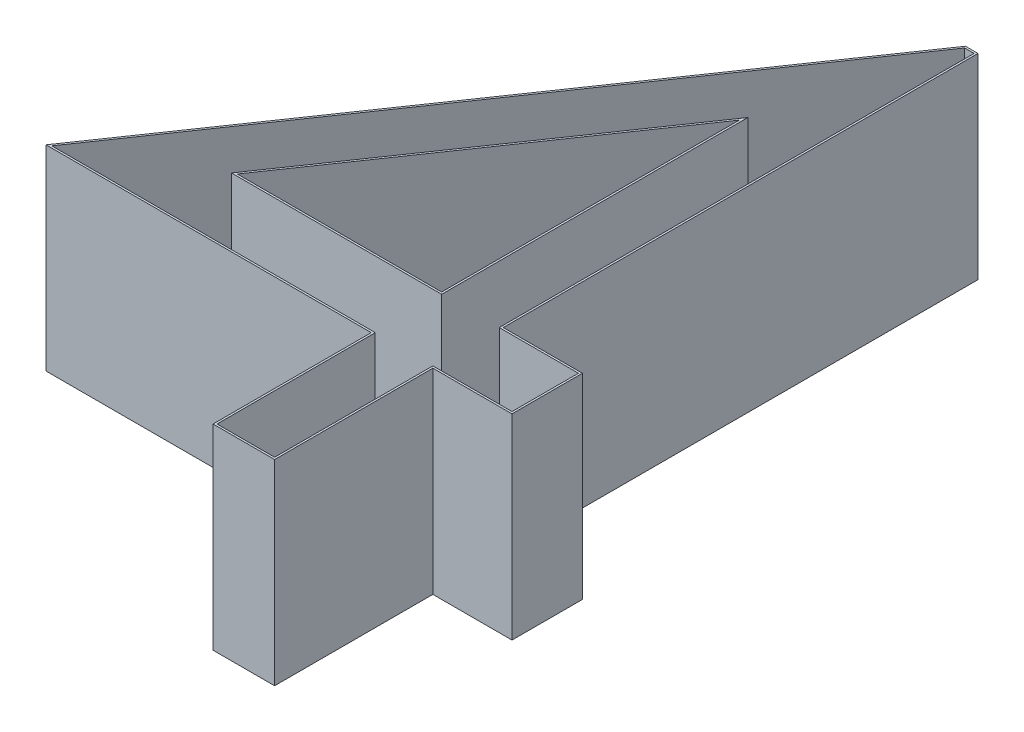
ISO-10303-21;
HEADER;
FILE_DESCRIPTION(('STEP AP214'),'2;1');
FILE_NAME('part.step','',(''),(''),'','','');
FILE_SCHEMA(('AUTOMOTIVE_DESIGN { 1 0 10303 214 1 1 1 1 }'));
ENDSEC;
DATA;
#1=APPLICATION_CONTEXT('core data for automotive mechanical design processes');
#2=APPLICATION_PROTOCOL_DEFINITION('international standard','automotive_design',2000,#1);
#3=PRODUCT_CONTEXT('',#1,'mechanical');
#4=PRODUCT('Part','Part','',(#3));
#5=PRODUCT_RELATED_PRODUCT_CATEGORY('part','',(#4));
#6=PRODUCT_DEFINITION_FORMATION('','',#4);
#7=PRODUCT_DEFINITION_CONTEXT('part definition',#1,'design');
#8=PRODUCT_DEFINITION('design','',#6,#7);
#9=PRODUCT_DEFINITION_SHAPE('','',#8);
#10=(LENGTH_UNIT() NAMED_UNIT(*) SI_UNIT(.MILLI.,.METRE.));
#11=(NAMED_UNIT(*) PLANE_ANGLE_UNIT() SI_UNIT($,.RADIAN.));
#12=(NAMED_UNIT(*) SI_UNIT($,.STERADIAN.) SOLID_ANGLE_UNIT());
#13=UNCERTAINTY_MEASURE_WITH_UNIT(LENGTH_MEASURE(1.E-05),#10,'distance_accuracy_value','');
#14=(GEOMETRIC_REPRESENTATION_CONTEXT(3) GLOBAL_UNCERTAINTY_ASSIGNED_CONTEXT((#13)) GLOBAL_UNIT_ASSIGNED_CONTEXT((#10,
#11,#12)) REPRESENTATION_CONTEXT('',''));
#15=CARTESIAN_POINT('',(0.,0.,0.));
#16=DIRECTION('',(0.,0.,1.));
#17=DIRECTION('',(1.,0.,0.));
#18=AXIS2_PLACEMENT_3D('',#15,#16,#17);
#19=CARTESIAN_POINT('',(0.,1.,0.));
#20=DIRECTION('',(0.,-1.,0.));
#21=DIRECTION('',(0.,0.,-1.));
#22=AXIS2_PLACEMENT_3D('',#19,#20,#21);
#23=PLANE('',#22);
#24=DIRECTION('',(-0.566105543193208,0.,0.824332768950697));
#25=VECTOR('',#24,1.);
#26=CARTESIAN_POINT('',(2.05043585939203,1.,-3.57974358974359));
#27=LINE('',#26,#25);
#28=CARTESIAN_POINT('',(2.05043585939203,1.,-3.57974358974359));
#29=VERTEX_POINT('',#28);
#30=CARTESIAN_POINT('',(0.153613847398646,1.,-0.817692307692308));
#31=VERTEX_POINT('',#30);
#32=EDGE_CURVE('E55',#29,#31,#27,.T.);
#33=ORIENTED_EDGE('',*,*,#32,.F.);
#34=DIRECTION('',(-1.,0.,0.));
#35=VECTOR('',#34,1.);
#36=CARTESIAN_POINT('',(2.09897435897436,1.,-3.57974358974359));
#37=LINE('',#36,#35);
#38=CARTESIAN_POINT('',(2.09897435897436,1.,-3.57974358974359));
#39=VERTEX_POINT('',#38);
#40=EDGE_CURVE('E131',#39,#29,#37,.T.);
#41=ORIENTED_EDGE('',*,*,#40,.F.);
#42=DIRECTION('',(0.,0.,-1.));
#43=VECTOR('',#42,1.);
#44=CARTESIAN_POINT('',(2.09897435897436,1.,-1.15666666666667));
#45=LINE('',#44,#43);
#46=CARTESIAN_POINT('',(2.09897435897436,1.,-1.15666666666667));
#47=VERTEX_POINT('',#46);
#48=EDGE_CURVE('E196',#47,#39,#45,.T.);
#49=ORIENTED_EDGE('',*,*,#48,.F.);
#50=DIRECTION('',(-1.,0.,0.));
#51=VECTOR('',#50,1.);
#52=CARTESIAN_POINT('',(2.50282051282051,1.,-1.15666666666667));
#53=LINE('',#52,#51);
#54=CARTESIAN_POINT('',(2.50282051282051,1.,-1.15666666666667));
#55=VERTEX_POINT('',#54);
#56=EDGE_CURVE('E192',#55,#47,#53,.T.);
#57=ORIENTED_EDGE('',*,*,#56,.F.);
#58=DIRECTION('',(0.,0.,-1.));
#59=VECTOR('',#58,1.);
#60=CARTESIAN_POINT('',(2.50282051282051,1.,-0.817692307692308));
#61=LINE('',#60,#59);
#62=CARTESIAN_POINT('',(2.50282051282051,1.,-0.817692307692308));
#63=VERTEX_POINT('',#62);
#64=EDGE_CURVE('E188',#63,#55,#61,.T.);
#65=ORIENTED_EDGE('',*,*,#64,.F.);
#66=DIRECTION('',(1.,0.,0.));
#67=VECTOR('',#66,1.);
#68=CARTESIAN_POINT('',(2.09897435897436,1.,-0.817692307692308));
#69=LINE('',#68,#67);
#70=CARTESIAN_POINT('',(2.09897435897436,1.,-0.817692307692308));
#71=VERTEX_POINT('',#70);
#72=EDGE_CURVE('E184',#71,#63,#69,.T.);
#73=ORIENTED_EDGE('',*,*,#72,.F.);
#74=DIRECTION('',(0.,0.,-1.));
#75=VECTOR('',#74,1.);
#76=CARTESIAN_POINT('',(2.09897435897436,1.,-0.01));
#77=LINE('',#76,#75);
#78=CARTESIAN_POINT('',(2.09897435897436,1.,-0.01));
#79=VERTEX_POINT('',#78);
#80=EDGE_CURVE('E180',#79,#71,#77,.T.);
#81=ORIENTED_EDGE('',*,*,#80,.F.);
#82=DIRECTION('',(1.,0.,0.));
#83=VECTOR('',#82,1.);
#84=CARTESIAN_POINT('',(1.8048717948718,1.,-0.01));
#85=LINE('',#84,#83);
#86=CARTESIAN_POINT('',(1.8048717948718,1.,-0.01));
#87=VERTEX_POINT('',#86);
#88=EDGE_CURVE('E122',#87,#79,#85,.T.);
#89=ORIENTED_EDGE('',*,*,#88,.F.);
#90=DIRECTION('',(0.,0.,1.));
#91=VECTOR('',#90,1.);
#92=CARTESIAN_POINT('',(1.8048717948718,1.,-0.817692307692308));
#93=LINE('',#92,#91);
#94=CARTESIAN_POINT('',(1.8048717948718,1.,-0.817692307692308));
#95=VERTEX_POINT('',#94);
#96=EDGE_CURVE('E107',#95,#87,#93,.T.);
#97=ORIENTED_EDGE('',*,*,#96,.F.);
#98=DIRECTION('',(1.,0.,0.));
#99=VECTOR('',#98,1.);
#100=CARTESIAN_POINT('',(0.153613847398646,1.,-0.817692307692308));
#101=LINE('',#100,#99);
#102=EDGE_CURVE('E112',#31,#95,#101,.T.);
#103=ORIENTED_EDGE('',*,*,#102,.F.);
#104=EDGE_LOOP('',(#33,#41,#49,#57,#65,#73,#81,#89,#97,#103));
#105=FACE_BOUND('',#104,.T.);
#106=DIRECTION('',(0.566105543193208,0.,-0.824332768950697));
#107=VECTOR('',#106,1.);
#108=CARTESIAN_POINT('',(0.134615384615385,1.,-0.807692307692308));
#109=LINE('',#108,#107);
#110=CARTESIAN_POINT('',(0.134615384615385,1.,-0.807692307692308));
#111=VERTEX_POINT('',#110);
#112=CARTESIAN_POINT('',(2.04517227564103,1.,-3.58974358974359));
#113=VERTEX_POINT('',#112);
#114=EDGE_CURVE('E307',#111,#113,#109,.T.);
#115=ORIENTED_EDGE('',*,*,#114,.F.);
#116=DIRECTION('',(-1.,0.,0.));
#117=VECTOR('',#116,1.);
#118=CARTESIAN_POINT('',(1.7948717948718,1.,-0.807692307692308));
#119=LINE('',#118,#117);
#120=CARTESIAN_POINT('',(1.7948717948718,1.,-0.807692307692308));
#121=VERTEX_POINT('',#120);
#122=EDGE_CURVE('E306',#121,#111,#119,.T.);
#123=ORIENTED_EDGE('',*,*,#122,.F.);
#124=DIRECTION('',(0.,0.,-1.));
#125=VECTOR('',#124,1.);
#126=CARTESIAN_POINT('',(1.7948717948718,1.,0.));
#127=LINE('',#126,#125);
#128=CARTESIAN_POINT('',(1.7948717948718,1.,0.));
#129=VERTEX_POINT('',#128);
#130=EDGE_CURVE('E347',#129,#121,#127,.T.);
#131=ORIENTED_EDGE('',*,*,#130,.F.);
#132=DIRECTION('',(-1.,0.,0.));
#133=VECTOR('',#132,1.);
#134=CARTESIAN_POINT('',(2.10897435897436,1.,0.));
#135=LINE('',#134,#133);
#136=CARTESIAN_POINT('',(2.10897435897436,1.,0.));
#137=VERTEX_POINT('',#136);
#138=EDGE_CURVE('E343',#137,#129,#135,.T.);
#139=ORIENTED_EDGE('',*,*,#138,.F.);
#140=DIRECTION('',(0.,0.,1.));
#141=VECTOR('',#140,1.);
#142=CARTESIAN_POINT('',(2.10897435897436,1.,-0.807692307692308));
#143=LINE('',#142,#141);
#144=CARTESIAN_POINT('',(2.10897435897436,1.,-0.807692307692308));
#145=VERTEX_POINT('',#144);
#146=EDGE_CURVE('E339',#145,#137,#143,.T.);
#147=ORIENTED_EDGE('',*,*,#146,.F.);
#148=DIRECTION('',(-1.,0.,0.));
#149=VECTOR('',#148,1.);
#150=CARTESIAN_POINT('',(2.51282051282051,1.,-0.807692307692308));
#151=LINE('',#150,#149);
#152=CARTESIAN_POINT('',(2.51282051282051,1.,-0.807692307692308));
#153=VERTEX_POINT('',#152);
#154=EDGE_CURVE('E335',#153,#145,#151,.T.);
#155=ORIENTED_EDGE('',*,*,#154,.F.);
#156=DIRECTION('',(0.,0.,1.));
#157=VECTOR('',#156,1.);
#158=CARTESIAN_POINT('',(2.51282051282051,1.,-1.16666666666667));
#159=LINE('',#158,#157);
#160=CARTESIAN_POINT('',(2.51282051282051,1.,-1.16666666666667));
#161=VERTEX_POINT('',#160);
#162=EDGE_CURVE('E331',#161,#153,#159,.T.);
#163=ORIENTED_EDGE('',*,*,#162,.F.);
#164=DIRECTION('',(1.,0.,0.));
#165=VECTOR('',#164,1.);
#166=CARTESIAN_POINT('',(2.10897435897436,1.,-1.16666666666667));
#167=LINE('',#166,#165);
#168=CARTESIAN_POINT('',(2.10897435897436,1.,-1.16666666666667));
#169=VERTEX_POINT('',#168);
#170=EDGE_CURVE('E327',#169,#161,#167,.T.);
#171=ORIENTED_EDGE('',*,*,#170,.F.);
#172=DIRECTION('',(0.,0.,1.));
#173=VECTOR('',#172,1.);
#174=CARTESIAN_POINT('',(2.10897435897436,1.,-3.58974358974359));
#175=LINE('',#174,#173);
#176=CARTESIAN_POINT('',(2.10897435897436,1.,-3.58974358974359));
#177=VERTEX_POINT('',#176);
#178=EDGE_CURVE('E315',#177,#169,#175,.T.);
#179=ORIENTED_EDGE('',*,*,#178,.F.);
#180=DIRECTION('',(1.,0.,0.));
#181=VECTOR('',#180,1.);
#182=CARTESIAN_POINT('',(2.04517227564103,1.,-3.58974358974359));
#183=LINE('',#182,#181);
#184=EDGE_CURVE('E299',#113,#177,#183,.T.);
#185=ORIENTED_EDGE('',*,*,#184,.F.);
#186=EDGE_LOOP('',(#115,#123,#131,#139,#147,#155,#163,#171,#179,#185));
#187=FACE_BOUND('',#186,.T.);
#188=ADVANCED_FACE('F45',(#105,#187),#23,.F.);
#189=CARTESIAN_POINT('',(0.,0.,0.));
#190=DIRECTION('',(0.,-1.,0.));
#191=DIRECTION('',(0.,0.,-1.));
#192=AXIS2_PLACEMENT_3D('',#189,#190,#191);
#193=PLANE('',#192);
#194=DIRECTION('',(-1.,0.,0.));
#195=VECTOR('',#194,1.);
#196=CARTESIAN_POINT('',(2.09897435897436,0.,-3.57974358974359));
#197=LINE('',#196,#195);
#198=CARTESIAN_POINT('',(2.09897435897436,0.,-3.57974358974359));
#199=VERTEX_POINT('',#198);
#200=CARTESIAN_POINT('',(2.05043585939203,0.,-3.57974358974359));
#201=VERTEX_POINT('',#200);
#202=EDGE_CURVE('E49',#199,#201,#197,.T.);
#203=ORIENTED_EDGE('',*,*,#202,.T.);
#204=DIRECTION('',(-0.566105543193208,0.,0.824332768950697));
#205=VECTOR('',#204,1.);
#206=CARTESIAN_POINT('',(2.05043585939203,0.,-3.57974358974359));
#207=LINE('',#206,#205);
#208=CARTESIAN_POINT('',(0.153613847398645,0.,-0.817692307692308));
#209=VERTEX_POINT('',#208);
#210=EDGE_CURVE('E157',#201,#209,#207,.T.);
#211=ORIENTED_EDGE('',*,*,#210,.T.);
#212=DIRECTION('',(1.,0.,0.));
#213=VECTOR('',#212,1.);
#214=CARTESIAN_POINT('',(0.153613847398646,0.,-0.817692307692308));
#215=LINE('',#214,#213);
#216=CARTESIAN_POINT('',(1.8048717948718,0.,-0.817692307692308));
#217=VERTEX_POINT('',#216);
#218=EDGE_CURVE('E156',#209,#217,#215,.T.);
#219=ORIENTED_EDGE('',*,*,#218,.T.);
#220=DIRECTION('',(0.,0.,1.));
#221=VECTOR('',#220,1.);
#222=CARTESIAN_POINT('',(1.8048717948718,0.,-0.817692307692308));
#223=LINE('',#222,#221);
#224=CARTESIAN_POINT('',(1.8048717948718,0.,-0.01));
#225=VERTEX_POINT('',#224);
#226=EDGE_CURVE('E110',#217,#225,#223,.T.);
#227=ORIENTED_EDGE('',*,*,#226,.T.);
#228=DIRECTION('',(1.,0.,0.));
#229=VECTOR('',#228,1.);
#230=CARTESIAN_POINT('',(1.8048717948718,0.,-0.01));
#231=LINE('',#230,#229);
#232=CARTESIAN_POINT('',(2.09897435897436,0.,-0.01));
#233=VERTEX_POINT('',#232);
#234=EDGE_CURVE('E152',#225,#233,#231,.T.);
#235=ORIENTED_EDGE('',*,*,#234,.T.);
#236=DIRECTION('',(0.,0.,-1.));
#237=VECTOR('',#236,1.);
#238=CARTESIAN_POINT('',(2.09897435897436,0.,-0.01));
#239=LINE('',#238,#237);
#240=CARTESIAN_POINT('',(2.09897435897436,0.,-0.817692307692308));
#241=VERTEX_POINT('',#240);
#242=EDGE_CURVE('E149',#233,#241,#239,.T.);
#243=ORIENTED_EDGE('',*,*,#242,.T.);
#244=DIRECTION('',(1.,0.,0.));
#245=VECTOR('',#244,1.);
#246=CARTESIAN_POINT('',(2.09897435897436,0.,-0.817692307692308));
#247=LINE('',#246,#245);
#248=CARTESIAN_POINT('',(2.50282051282051,0.,-0.817692307692308));
#249=VERTEX_POINT('',#248);
#250=EDGE_CURVE('E146',#241,#249,#247,.T.);
#251=ORIENTED_EDGE('',*,*,#250,.T.);
#252=DIRECTION('',(0.,0.,-1.));
#253=VECTOR('',#252,1.);
#254=CARTESIAN_POINT('',(2.50282051282051,0.,-0.817692307692308));
#255=LINE('',#254,#253);
#256=CARTESIAN_POINT('',(2.50282051282051,0.,-1.15666666666667));
#257=VERTEX_POINT('',#256);
#258=EDGE_CURVE('E143',#249,#257,#255,.T.);
#259=ORIENTED_EDGE('',*,*,#258,.T.);
#260=DIRECTION('',(-1.,0.,0.));
#261=VECTOR('',#260,1.);
#262=CARTESIAN_POINT('',(2.50282051282051,0.,-1.15666666666667));
#263=LINE('',#262,#261);
#264=CARTESIAN_POINT('',(2.09897435897436,0.,-1.15666666666667));
#265=VERTEX_POINT('',#264);
#266=EDGE_CURVE('E140',#257,#265,#263,.T.);
#267=ORIENTED_EDGE('',*,*,#266,.T.);
#268=DIRECTION('',(0.,0.,-1.));
#269=VECTOR('',#268,1.);
#270=CARTESIAN_POINT('',(2.09897435897436,0.,-1.15666666666667));
#271=LINE('',#270,#269);
#272=EDGE_CURVE('E136',#265,#199,#271,.T.);
#273=ORIENTED_EDGE('',*,*,#272,.T.);
#274=EDGE_LOOP('',(#203,#211,#219,#227,#235,#243,#251,#259,#267,#273));
#275=FACE_BOUND('',#274,.T.);
#276=DIRECTION('',(0.566105543193208,0.,-0.824332768950697));
#277=VECTOR('',#276,1.);
#278=CARTESIAN_POINT('',(0.134615384615385,0.,-0.807692307692308));
#279=LINE('',#278,#277);
#280=CARTESIAN_POINT('',(0.134615384615385,0.,-0.807692307692308));
#281=VERTEX_POINT('',#280);
#282=CARTESIAN_POINT('',(2.04517227564103,0.,-3.58974358974359));
#283=VERTEX_POINT('',#282);
#284=EDGE_CURVE('E139',#281,#283,#279,.T.);
#285=ORIENTED_EDGE('',*,*,#284,.T.);
#286=DIRECTION('',(1.,0.,0.));
#287=VECTOR('',#286,1.);
#288=CARTESIAN_POINT('',(2.04517227564103,0.,-3.58974358974359));
#289=LINE('',#288,#287);
#290=CARTESIAN_POINT('',(2.10897435897436,0.,-3.58974358974359));
#291=VERTEX_POINT('',#290);
#292=EDGE_CURVE('E301',#283,#291,#289,.T.);
#293=ORIENTED_EDGE('',*,*,#292,.T.);
#294=DIRECTION('',(0.,0.,1.));
#295=VECTOR('',#294,1.);
#296=CARTESIAN_POINT('',(2.10897435897436,0.,-3.58974358974359));
#297=LINE('',#296,#295);
#298=CARTESIAN_POINT('',(2.10897435897436,0.,-1.16666666666667));
#299=VERTEX_POINT('',#298);
#300=EDGE_CURVE('E353',#291,#299,#297,.T.);
#301=ORIENTED_EDGE('',*,*,#300,.T.);
#302=DIRECTION('',(1.,0.,0.));
#303=VECTOR('',#302,1.);
#304=CARTESIAN_POINT('',(2.10897435897436,0.,-1.16666666666667));
#305=LINE('',#304,#303);
#306=CARTESIAN_POINT('',(2.51282051282051,0.,-1.16666666666667));
#307=VERTEX_POINT('',#306);
#308=EDGE_CURVE('E356',#299,#307,#305,.T.);
#309=ORIENTED_EDGE('',*,*,#308,.T.);
#310=DIRECTION('',(0.,0.,1.));
#311=VECTOR('',#310,1.);
#312=CARTESIAN_POINT('',(2.51282051282051,0.,-1.16666666666667));
#313=LINE('',#312,#311);
#314=CARTESIAN_POINT('',(2.51282051282051,0.,-0.807692307692308));
#315=VERTEX_POINT('',#314);
#316=EDGE_CURVE('E359',#307,#315,#313,.T.);
#317=ORIENTED_EDGE('',*,*,#316,.T.);
#318=DIRECTION('',(-1.,0.,0.));
#319=VECTOR('',#318,1.);
#320=CARTESIAN_POINT('',(2.51282051282051,0.,-0.807692307692308));
#321=LINE('',#320,#319);
#322=CARTESIAN_POINT('',(2.10897435897436,0.,-0.807692307692308));
#323=VERTEX_POINT('',#322);
#324=EDGE_CURVE('E362',#315,#323,#321,.T.);
#325=ORIENTED_EDGE('',*,*,#324,.T.);
#326=DIRECTION('',(0.,0.,1.));
#327=VECTOR('',#326,1.);
#328=CARTESIAN_POINT('',(2.10897435897436,0.,-0.807692307692308));
#329=LINE('',#328,#327);
#330=CARTESIAN_POINT('',(2.10897435897436,0.,0.));
#331=VERTEX_POINT('',#330);
#332=EDGE_CURVE('E365',#323,#331,#329,.T.);
#333=ORIENTED_EDGE('',*,*,#332,.T.);
#334=DIRECTION('',(-1.,0.,0.));
#335=VECTOR('',#334,1.);
#336=CARTESIAN_POINT('',(2.10897435897436,0.,0.));
#337=LINE('',#336,#335);
#338=CARTESIAN_POINT('',(1.7948717948718,0.,0.));
#339=VERTEX_POINT('',#338);
#340=EDGE_CURVE('E368',#331,#339,#337,.T.);
#341=ORIENTED_EDGE('',*,*,#340,.T.);
#342=DIRECTION('',(0.,0.,-1.));
#343=VECTOR('',#342,1.);
#344=CARTESIAN_POINT('',(1.7948717948718,0.,0.));
#345=LINE('',#344,#343);
#346=CARTESIAN_POINT('',(1.7948717948718,0.,-0.807692307692308));
#347=VERTEX_POINT('',#346);
#348=EDGE_CURVE('E322',#339,#347,#345,.T.);
#349=ORIENTED_EDGE('',*,*,#348,.T.);
#350=DIRECTION('',(-1.,0.,0.));
#351=VECTOR('',#350,1.);
#352=CARTESIAN_POINT('',(1.7948717948718,0.,-0.807692307692308));
#353=LINE('',#352,#351);
#354=EDGE_CURVE('E320',#347,#281,#353,.T.);
#355=ORIENTED_EDGE('',*,*,#354,.T.);
#356=EDGE_LOOP('',(#285,#293,#301,#309,#317,#325,#333,#341,#349,#355));
#357=FACE_BOUND('',#356,.T.);
#358=ADVANCED_FACE('F47',(#275,#357),#193,.T.);
#359=CARTESIAN_POINT('',(0.134615384615385,1.,-0.807692307692308));
#360=DIRECTION('',(-0.824332768950697,0.,-0.566105543193208));
#361=DIRECTION('',(-0.566105543193208,0.,0.824332768950697));
#362=AXIS2_PLACEMENT_3D('',#359,#360,#361);
#363=PLANE('',#362);
#364=ORIENTED_EDGE('',*,*,#284,.F.);
#365=DIRECTION('',(0.,-1.,0.));
#366=VECTOR('',#365,1.);
#367=CARTESIAN_POINT('',(0.134615384615385,1.,-0.807692307692308));
#368=LINE('',#367,#366);
#369=EDGE_CURVE('E319',#111,#281,#368,.T.);
#370=ORIENTED_EDGE('',*,*,#369,.F.);
#371=ORIENTED_EDGE('',*,*,#114,.T.);
#372=DIRECTION('',(0.,-1.,0.));
#373=VECTOR('',#372,1.);
#374=CARTESIAN_POINT('',(2.04517227564103,1.,-3.58974358974359));
#375=LINE('',#374,#373);
#376=EDGE_CURVE('E296',#113,#283,#375,.T.);
#377=ORIENTED_EDGE('',*,*,#376,.T.);
#378=EDGE_LOOP('',(#364,#370,#371,#377));
#379=FACE_BOUND('',#378,.T.);
#380=ADVANCED_FACE('F318',(#379),#363,.T.);
#381=CARTESIAN_POINT('',(1.7948717948718,1.,-0.807692307692308));
#382=DIRECTION('',(0.,0.,1.));
#383=DIRECTION('',(1.,0.,0.));
#384=AXIS2_PLACEMENT_3D('',#381,#382,#383);
#385=PLANE('',#384);
#386=ORIENTED_EDGE('',*,*,#354,.F.);
#387=DIRECTION('',(0.,-1.,0.));
#388=VECTOR('',#387,1.);
#389=CARTESIAN_POINT('',(1.7948717948718,1.,-0.807692307692308));
#390=LINE('',#389,#388);
#391=EDGE_CURVE('E346',#121,#347,#390,.T.);
#392=ORIENTED_EDGE('',*,*,#391,.F.);
#393=ORIENTED_EDGE('',*,*,#122,.T.);
#394=ORIENTED_EDGE('',*,*,#369,.T.);
#395=EDGE_LOOP('',(#386,#392,#393,#394));
#396=FACE_BOUND('',#395,.T.);
#397=ADVANCED_FACE('F388',(#396),#385,.T.);
#398=CARTESIAN_POINT('',(1.7948717948718,1.,0.));
#399=DIRECTION('',(-1.,0.,0.));
#400=DIRECTION('',(0.,0.,1.));
#401=AXIS2_PLACEMENT_3D('',#398,#399,#400);
#402=PLANE('',#401);
#403=ORIENTED_EDGE('',*,*,#348,.F.);
#404=DIRECTION('',(0.,-1.,0.));
#405=VECTOR('',#404,1.);
#406=CARTESIAN_POINT('',(1.7948717948718,1.,0.));
#407=LINE('',#406,#405);
#408=EDGE_CURVE('E342',#129,#339,#407,.T.);
#409=ORIENTED_EDGE('',*,*,#408,.F.);
#410=ORIENTED_EDGE('',*,*,#130,.T.);
#411=ORIENTED_EDGE('',*,*,#391,.T.);
#412=EDGE_LOOP('',(#403,#409,#410,#411));
#413=FACE_BOUND('',#412,.T.);
#414=ADVANCED_FACE('F444',(#413),#402,.T.);
#415=CARTESIAN_POINT('',(2.10897435897436,1.,0.));
#416=DIRECTION('',(0.,0.,1.));
#417=DIRECTION('',(1.,0.,0.));
#418=AXIS2_PLACEMENT_3D('',#415,#416,#417);
#419=PLANE('',#418);
#420=ORIENTED_EDGE('',*,*,#340,.F.);
#421=DIRECTION('',(0.,-1.,0.));
#422=VECTOR('',#421,1.);
#423=CARTESIAN_POINT('',(2.10897435897436,1.,0.));
#424=LINE('',#423,#422);
#425=EDGE_CURVE('E338',#137,#331,#424,.T.);
#426=ORIENTED_EDGE('',*,*,#425,.F.);
#427=ORIENTED_EDGE('',*,*,#138,.T.);
#428=ORIENTED_EDGE('',*,*,#408,.T.);
#429=EDGE_LOOP('',(#420,#426,#427,#428));
#430=FACE_BOUND('',#429,.T.);
#431=ADVANCED_FACE('F395',(#430),#419,.T.);
#432=CARTESIAN_POINT('',(2.10897435897436,1.,-0.807692307692308));
#433=DIRECTION('',(1.,0.,0.));
#434=DIRECTION('',(0.,0.,-1.));
#435=AXIS2_PLACEMENT_3D('',#432,#433,#434);
#436=PLANE('',#435);
#437=ORIENTED_EDGE('',*,*,#332,.F.);
#438=DIRECTION('',(0.,-1.,0.));
#439=VECTOR('',#438,1.);
#440=CARTESIAN_POINT('',(2.10897435897436,1.,-0.807692307692308));
#441=LINE('',#440,#439);
#442=EDGE_CURVE('E334',#145,#323,#441,.T.);
#443=ORIENTED_EDGE('',*,*,#442,.F.);
#444=ORIENTED_EDGE('',*,*,#146,.T.);
#445=ORIENTED_EDGE('',*,*,#425,.T.);
#446=EDGE_LOOP('',(#437,#443,#444,#445));
#447=FACE_BOUND('',#446,.T.);
#448=ADVANCED_FACE('F398',(#447),#436,.T.);
#449=CARTESIAN_POINT('',(2.51282051282051,1.,-0.807692307692308));
#450=DIRECTION('',(0.,0.,1.));
#451=DIRECTION('',(1.,0.,0.));
#452=AXIS2_PLACEMENT_3D('',#449,#450,#451);
#453=PLANE('',#452);
#454=ORIENTED_EDGE('',*,*,#324,.F.);
#455=DIRECTION('',(0.,-1.,0.));
#456=VECTOR('',#455,1.);
#457=CARTESIAN_POINT('',(2.51282051282051,1.,-0.807692307692308));
#458=LINE('',#457,#456);
#459=EDGE_CURVE('E330',#153,#315,#458,.T.);
#460=ORIENTED_EDGE('',*,*,#459,.F.);
#461=ORIENTED_EDGE('',*,*,#154,.T.);
#462=ORIENTED_EDGE('',*,*,#442,.T.);
#463=EDGE_LOOP('',(#454,#460,#461,#462));
#464=FACE_BOUND('',#463,.T.);
#465=ADVANCED_FACE('F403',(#464),#453,.T.);
#466=CARTESIAN_POINT('',(2.51282051282051,1.,-1.16666666666667));
#467=DIRECTION('',(1.,0.,0.));
#468=DIRECTION('',(0.,0.,-1.));
#469=AXIS2_PLACEMENT_3D('',#466,#467,#468);
#470=PLANE('',#469);
#471=ORIENTED_EDGE('',*,*,#316,.F.);
#472=DIRECTION('',(0.,-1.,0.));
#473=VECTOR('',#472,1.);
#474=CARTESIAN_POINT('',(2.51282051282051,1.,-1.16666666666667));
#475=LINE('',#474,#473);
#476=EDGE_CURVE('E326',#161,#307,#475,.T.);
#477=ORIENTED_EDGE('',*,*,#476,.F.);
#478=ORIENTED_EDGE('',*,*,#162,.T.);
#479=ORIENTED_EDGE('',*,*,#459,.T.);
#480=EDGE_LOOP('',(#471,#477,#478,#479));
#481=FACE_BOUND('',#480,.T.);
#482=ADVANCED_FACE('F406',(#481),#470,.T.);
#483=CARTESIAN_POINT('',(2.10897435897436,1.,-1.16666666666667));
#484=DIRECTION('',(0.,0.,-1.));
#485=DIRECTION('',(-1.,0.,0.));
#486=AXIS2_PLACEMENT_3D('',#483,#484,#485);
#487=PLANE('',#486);
#488=ORIENTED_EDGE('',*,*,#308,.F.);
#489=DIRECTION('',(0.,-1.,0.));
#490=VECTOR('',#489,1.);
#491=CARTESIAN_POINT('',(2.10897435897436,1.,-1.16666666666667));
#492=LINE('',#491,#490);
#493=EDGE_CURVE('E316',#169,#299,#492,.T.);
#494=ORIENTED_EDGE('',*,*,#493,.F.);
#495=ORIENTED_EDGE('',*,*,#170,.T.);
#496=ORIENTED_EDGE('',*,*,#476,.T.);
#497=EDGE_LOOP('',(#488,#494,#495,#496));
#498=FACE_BOUND('',#497,.T.);
#499=ADVANCED_FACE('F408',(#498),#487,.T.);
#500=CARTESIAN_POINT('',(2.10897435897436,1.,-3.58974358974359));
#501=DIRECTION('',(1.,0.,0.));
#502=DIRECTION('',(0.,0.,-1.));
#503=AXIS2_PLACEMENT_3D('',#500,#501,#502);
#504=PLANE('',#503);
#505=ORIENTED_EDGE('',*,*,#300,.F.);
#506=DIRECTION('',(0.,-1.,0.));
#507=VECTOR('',#506,1.);
#508=CARTESIAN_POINT('',(2.10897435897436,1.,-3.58974358974359));
#509=LINE('',#508,#507);
#510=EDGE_CURVE('E135',#177,#291,#509,.T.);
#511=ORIENTED_EDGE('',*,*,#510,.F.);
#512=ORIENTED_EDGE('',*,*,#178,.T.);
#513=ORIENTED_EDGE('',*,*,#493,.T.);
#514=EDGE_LOOP('',(#505,#511,#512,#513));
#515=FACE_BOUND('',#514,.T.);
#516=ADVANCED_FACE('F383',(#515),#504,.T.);
#517=CARTESIAN_POINT('',(2.04517227564103,1.,-3.58974358974359));
#518=DIRECTION('',(0.,0.,-1.));
#519=DIRECTION('',(-1.,0.,0.));
#520=AXIS2_PLACEMENT_3D('',#517,#518,#519);
#521=PLANE('',#520);
#522=ORIENTED_EDGE('',*,*,#292,.F.);
#523=ORIENTED_EDGE('',*,*,#376,.F.);
#524=ORIENTED_EDGE('',*,*,#184,.T.);
#525=ORIENTED_EDGE('',*,*,#510,.T.);
#526=EDGE_LOOP('',(#522,#523,#524,#525));
#527=FACE_BOUND('',#526,.T.);
#528=ADVANCED_FACE('F298',(#527),#521,.T.);
#529=CARTESIAN_POINT('',(2.09897435897436,0.,-3.57974358974359));
#530=DIRECTION('',(0.,0.,-1.));
#531=DIRECTION('',(-1.,0.,0.));
#532=AXIS2_PLACEMENT_3D('',#529,#530,#531);
#533=PLANE('',#532);
#534=ORIENTED_EDGE('',*,*,#40,.T.);
#535=DIRECTION('',(0.,1.,0.));
#536=VECTOR('',#535,1.);
#537=CARTESIAN_POINT('',(2.05043585939203,0.,-3.57974358974359));
#538=LINE('',#537,#536);
#539=EDGE_CURVE('E12',#201,#29,#538,.T.);
#540=ORIENTED_EDGE('',*,*,#539,.F.);
#541=ORIENTED_EDGE('',*,*,#202,.F.);
#542=DIRECTION('',(0.,1.,0.));
#543=VECTOR('',#542,1.);
#544=CARTESIAN_POINT('',(2.09897435897436,0.,-3.57974358974359));
#545=LINE('',#544,#543);
#546=EDGE_CURVE('E134',#199,#39,#545,.T.);
#547=ORIENTED_EDGE('',*,*,#546,.T.);
#548=EDGE_LOOP('',(#534,#540,#541,#547));
#549=FACE_BOUND('',#548,.T.);
#550=ADVANCED_FACE('F169',(#549),#533,.F.);
#551=CARTESIAN_POINT('',(2.09897435897436,0.,-1.15666666666667));
#552=DIRECTION('',(1.,0.,0.));
#553=DIRECTION('',(0.,0.,-1.));
#554=AXIS2_PLACEMENT_3D('',#551,#552,#553);
#555=PLANE('',#554);
#556=ORIENTED_EDGE('',*,*,#48,.T.);
#557=ORIENTED_EDGE('',*,*,#546,.F.);
#558=ORIENTED_EDGE('',*,*,#272,.F.);
#559=DIRECTION('',(0.,1.,0.));
#560=VECTOR('',#559,1.);
#561=CARTESIAN_POINT('',(2.09897435897436,0.,-1.15666666666667));
#562=LINE('',#561,#560);
#563=EDGE_CURVE('E193',#265,#47,#562,.T.);
#564=ORIENTED_EDGE('',*,*,#563,.T.);
#565=EDGE_LOOP('',(#556,#557,#558,#564));
#566=FACE_BOUND('',#565,.T.);
#567=ADVANCED_FACE('F230',(#566),#555,.F.);
#568=CARTESIAN_POINT('',(2.50282051282051,0.,-1.15666666666667));
#569=DIRECTION('',(0.,0.,-1.));
#570=DIRECTION('',(-1.,0.,0.));
#571=AXIS2_PLACEMENT_3D('',#568,#569,#570);
#572=PLANE('',#571);
#573=ORIENTED_EDGE('',*,*,#56,.T.);
#574=ORIENTED_EDGE('',*,*,#563,.F.);
#575=ORIENTED_EDGE('',*,*,#266,.F.);
#576=DIRECTION('',(0.,1.,0.));
#577=VECTOR('',#576,1.);
#578=CARTESIAN_POINT('',(2.50282051282051,0.,-1.15666666666667));
#579=LINE('',#578,#577);
#580=EDGE_CURVE('E189',#257,#55,#579,.T.);
#581=ORIENTED_EDGE('',*,*,#580,.T.);
#582=EDGE_LOOP('',(#573,#574,#575,#581));
#583=FACE_BOUND('',#582,.T.);
#584=ADVANCED_FACE('F227',(#583),#572,.F.);
#585=CARTESIAN_POINT('',(2.50282051282051,0.,-0.817692307692308));
#586=DIRECTION('',(1.,0.,0.));
#587=DIRECTION('',(0.,0.,-1.));
#588=AXIS2_PLACEMENT_3D('',#585,#586,#587);
#589=PLANE('',#588);
#590=ORIENTED_EDGE('',*,*,#64,.T.);
#591=ORIENTED_EDGE('',*,*,#580,.F.);
#592=ORIENTED_EDGE('',*,*,#258,.F.);
#593=DIRECTION('',(0.,1.,0.));
#594=VECTOR('',#593,1.);
#595=CARTESIAN_POINT('',(2.50282051282051,0.,-0.817692307692308));
#596=LINE('',#595,#594);
#597=EDGE_CURVE('E185',#249,#63,#596,.T.);
#598=ORIENTED_EDGE('',*,*,#597,.T.);
#599=EDGE_LOOP('',(#590,#591,#592,#598));
#600=FACE_BOUND('',#599,.T.);
#601=ADVANCED_FACE('F225',(#600),#589,.F.);
#602=CARTESIAN_POINT('',(2.09897435897436,0.,-0.817692307692308));
#603=DIRECTION('',(0.,0.,1.));
#604=DIRECTION('',(1.,0.,0.));
#605=AXIS2_PLACEMENT_3D('',#602,#603,#604);
#606=PLANE('',#605);
#607=ORIENTED_EDGE('',*,*,#72,.T.);
#608=ORIENTED_EDGE('',*,*,#597,.F.);
#609=ORIENTED_EDGE('',*,*,#250,.F.);
#610=DIRECTION('',(0.,1.,0.));
#611=VECTOR('',#610,1.);
#612=CARTESIAN_POINT('',(2.09897435897436,0.,-0.817692307692308));
#613=LINE('',#612,#611);
#614=EDGE_CURVE('E181',#241,#71,#613,.T.);
#615=ORIENTED_EDGE('',*,*,#614,.T.);
#616=EDGE_LOOP('',(#607,#608,#609,#615));
#617=FACE_BOUND('',#616,.T.);
#618=ADVANCED_FACE('F214',(#617),#606,.F.);
#619=CARTESIAN_POINT('',(2.09897435897436,0.,-0.01));
#620=DIRECTION('',(1.,0.,0.));
#621=DIRECTION('',(0.,0.,-1.));
#622=AXIS2_PLACEMENT_3D('',#619,#620,#621);
#623=PLANE('',#622);
#624=ORIENTED_EDGE('',*,*,#80,.T.);
#625=ORIENTED_EDGE('',*,*,#614,.F.);
#626=ORIENTED_EDGE('',*,*,#242,.F.);
#627=DIRECTION('',(0.,1.,0.));
#628=VECTOR('',#627,1.);
#629=CARTESIAN_POINT('',(2.09897435897436,0.,-0.01));
#630=LINE('',#629,#628);
#631=EDGE_CURVE('E177',#233,#79,#630,.T.);
#632=ORIENTED_EDGE('',*,*,#631,.T.);
#633=EDGE_LOOP('',(#624,#625,#626,#632));
#634=FACE_BOUND('',#633,.T.);
#635=ADVANCED_FACE('F207',(#634),#623,.F.);
#636=CARTESIAN_POINT('',(1.8048717948718,0.,-0.01));
#637=DIRECTION('',(0.,0.,1.));
#638=DIRECTION('',(1.,0.,0.));
#639=AXIS2_PLACEMENT_3D('',#636,#637,#638);
#640=PLANE('',#639);
#641=ORIENTED_EDGE('',*,*,#88,.T.);
#642=ORIENTED_EDGE('',*,*,#631,.F.);
#643=ORIENTED_EDGE('',*,*,#234,.F.);
#644=DIRECTION('',(0.,1.,0.));
#645=VECTOR('',#644,1.);
#646=CARTESIAN_POINT('',(1.8048717948718,0.,-0.01));
#647=LINE('',#646,#645);
#648=EDGE_CURVE('E123',#225,#87,#647,.T.);
#649=ORIENTED_EDGE('',*,*,#648,.T.);
#650=EDGE_LOOP('',(#641,#642,#643,#649));
#651=FACE_BOUND('',#650,.T.);
#652=ADVANCED_FACE('F223',(#651),#640,.F.);
#653=CARTESIAN_POINT('',(1.8048717948718,0.,-0.817692307692308));
#654=DIRECTION('',(-1.,0.,0.));
#655=DIRECTION('',(0.,0.,1.));
#656=AXIS2_PLACEMENT_3D('',#653,#654,#655);
#657=PLANE('',#656);
#658=ORIENTED_EDGE('',*,*,#96,.T.);
#659=ORIENTED_EDGE('',*,*,#648,.F.);
#660=ORIENTED_EDGE('',*,*,#226,.F.);
#661=DIRECTION('',(0.,1.,0.));
#662=VECTOR('',#661,1.);
#663=CARTESIAN_POINT('',(1.8048717948718,0.,-0.817692307692308));
#664=LINE('',#663,#662);
#665=EDGE_CURVE('E101',#217,#95,#664,.T.);
#666=ORIENTED_EDGE('',*,*,#665,.T.);
#667=EDGE_LOOP('',(#658,#659,#660,#666));
#668=FACE_BOUND('',#667,.T.);
#669=ADVANCED_FACE('F105',(#668),#657,.F.);
#670=CARTESIAN_POINT('',(0.153613847398646,0.,-0.817692307692308));
#671=DIRECTION('',(0.,0.,1.));
#672=DIRECTION('',(1.,0.,0.));
#673=AXIS2_PLACEMENT_3D('',#670,#671,#672);
#674=PLANE('',#673);
#675=ORIENTED_EDGE('',*,*,#102,.T.);
#676=ORIENTED_EDGE('',*,*,#665,.F.);
#677=ORIENTED_EDGE('',*,*,#218,.F.);
#678=DIRECTION('',(0.,1.,0.));
#679=VECTOR('',#678,1.);
#680=CARTESIAN_POINT('',(0.153613847398646,0.,-0.817692307692308));
#681=LINE('',#680,#679);
#682=EDGE_CURVE('E64',#209,#31,#681,.T.);
#683=ORIENTED_EDGE('',*,*,#682,.T.);
#684=EDGE_LOOP('',(#675,#676,#677,#683));
#685=FACE_BOUND('',#684,.T.);
#686=ADVANCED_FACE('F115',(#685),#674,.F.);
#687=CARTESIAN_POINT('',(2.05043585939203,0.,-3.57974358974359));
#688=DIRECTION('',(-0.824332768950697,0.,-0.566105543193208));
#689=DIRECTION('',(-0.566105543193208,0.,0.824332768950697));
#690=AXIS2_PLACEMENT_3D('',#687,#688,#689);
#691=PLANE('',#690);
#692=ORIENTED_EDGE('',*,*,#32,.T.);
#693=ORIENTED_EDGE('',*,*,#682,.F.);
#694=ORIENTED_EDGE('',*,*,#210,.F.);
#695=ORIENTED_EDGE('',*,*,#539,.T.);
#696=EDGE_LOOP('',(#692,#693,#694,#695));
#697=FACE_BOUND('',#696,.T.);
#698=ADVANCED_FACE('F173',(#697),#691,.F.);
#699=CLOSED_SHELL('',(#188,#358,#380,#397,#414,#431,#448,#465,#482,#499,#516,#528,#550,#567,
#584,#601,#618,#635,#652,#669,#686,#698));
#700=MANIFOLD_SOLID_BREP('B2',#699);
#701=CARTESIAN_POINT('',(1.7948717948718,1.,-1.16666666666667));
#702=DIRECTION('',(-1.,0.,0.));
#703=DIRECTION('',(0.,0.,1.));
#704=AXIS2_PLACEMENT_3D('',#701,#702,#703);
#705=PLANE('',#704);
#706=DIRECTION('',(0.,0.,-1.));
#707=VECTOR('',#706,1.);
#708=CARTESIAN_POINT('',(1.7948717948718,0.,-1.16666666666667));
#709=LINE('',#708,#707);
#710=CARTESIAN_POINT('',(1.7948717948718,0.,-1.16666666666667));
#711=VERTEX_POINT('',#710);
#712=CARTESIAN_POINT('',(1.7948717948718,0.,-2.68669871794872));
#713=VERTEX_POINT('',#712);
#714=EDGE_CURVE('E676',#711,#713,#709,.T.);
#715=ORIENTED_EDGE('',*,*,#714,.F.);
#716=DIRECTION('',(0.,-1.,0.));
#717=VECTOR('',#716,1.);
#718=CARTESIAN_POINT('',(1.7948717948718,1.,-1.16666666666667));
#719=LINE('',#718,#717);
#720=CARTESIAN_POINT('',(1.7948717948718,1.,-1.16666666666667));
#721=VERTEX_POINT('',#720);
#722=EDGE_CURVE('E43',#721,#711,#719,.T.);
#723=ORIENTED_EDGE('',*,*,#722,.F.);
#724=DIRECTION('',(0.,0.,-1.));
#725=VECTOR('',#724,1.);
#726=CARTESIAN_POINT('',(1.7948717948718,1.,-1.16666666666667));
#727=LINE('',#726,#725);
#728=CARTESIAN_POINT('',(1.7948717948718,1.,-2.68669871794872));
#729=VERTEX_POINT('',#728);
#730=EDGE_CURVE('E667',#721,#729,#727,.T.);
#731=ORIENTED_EDGE('',*,*,#730,.T.);
#732=DIRECTION('',(0.,-1.,0.));
#733=VECTOR('',#732,1.);
#734=CARTESIAN_POINT('',(1.7948717948718,1.,-2.68669871794872));
#735=LINE('',#734,#733);
#736=EDGE_CURVE('E595',#729,#713,#735,.T.);
#737=ORIENTED_EDGE('',*,*,#736,.T.);
#738=EDGE_LOOP('',(#715,#723,#731,#737));
#739=FACE_BOUND('',#738,.T.);
#740=ADVANCED_FACE('F587',(#739),#705,.T.);
#741=CARTESIAN_POINT('',(0.751602564102564,1.,-1.16666666666667));
#742=DIRECTION('',(0.,0.,-1.));
#743=DIRECTION('',(-1.,0.,0.));
#744=AXIS2_PLACEMENT_3D('',#741,#742,#743);
#745=PLANE('',#744);
#746=DIRECTION('',(1.,0.,0.));
#747=VECTOR('',#746,1.);
#748=CARTESIAN_POINT('',(0.751602564102564,0.,-1.16666666666667));
#749=LINE('',#748,#747);
#750=CARTESIAN_POINT('',(0.751602564102564,0.,-1.16666666666667));
#751=VERTEX_POINT('',#750);
#752=EDGE_CURVE('E643',#751,#711,#749,.T.);
#753=ORIENTED_EDGE('',*,*,#752,.F.);
#754=DIRECTION('',(0.,-1.,0.));
#755=VECTOR('',#754,1.);
#756=CARTESIAN_POINT('',(0.751602564102564,1.,-1.16666666666667));
#757=LINE('',#756,#755);
#758=CARTESIAN_POINT('',(0.751602564102564,1.,-1.16666666666667));
#759=VERTEX_POINT('',#758);
#760=EDGE_CURVE('E673',#759,#751,#757,.T.);
#761=ORIENTED_EDGE('',*,*,#760,.F.);
#762=DIRECTION('',(1.,0.,0.));
#763=VECTOR('',#762,1.);
#764=CARTESIAN_POINT('',(0.751602564102564,1.,-1.16666666666667));
#765=LINE('',#764,#763);
#766=EDGE_CURVE('E665',#759,#721,#765,.T.);
#767=ORIENTED_EDGE('',*,*,#766,.T.);
#768=ORIENTED_EDGE('',*,*,#722,.T.);
#769=EDGE_LOOP('',(#753,#761,#767,#768));
#770=FACE_BOUND('',#769,.T.);
#771=ADVANCED_FACE('F692',(#770),#745,.T.);
#772=CARTESIAN_POINT('',(0.,1.,0.));
#773=DIRECTION('',(0.,-1.,0.));
#774=DIRECTION('',(0.,0.,-1.));
#775=AXIS2_PLACEMENT_3D('',#772,#773,#774);
#776=PLANE('',#775);
#777=ORIENTED_EDGE('',*,*,#766,.F.);
#778=DIRECTION('',(-0.565883050718714,0.,0.82448552013318));
#779=VECTOR('',#778,1.);
#780=CARTESIAN_POINT('',(1.7948717948718,1.,-2.68669871794872));
#781=LINE('',#780,#779);
#782=EDGE_CURVE('E671',#729,#759,#781,.T.);
#783=ORIENTED_EDGE('',*,*,#782,.F.);
#784=ORIENTED_EDGE('',*,*,#730,.F.);
#785=EDGE_LOOP('',(#777,#783,#784));
#786=FACE_BOUND('',#785,.T.);
#787=DIRECTION('',(-0.565883050718714,0.,0.82448552013318));
#788=VECTOR('',#787,1.);
#789=CARTESIAN_POINT('',(1.8048717948718,1.,-2.71894010630301));
#790=LINE('',#789,#788);
#791=CARTESIAN_POINT('',(1.8048717948718,1.,-2.71894010630301));
#792=VERTEX_POINT('',#791);
#793=CARTESIAN_POINT('',(0.732610319697037,1.,-1.15666666666667));
#794=VERTEX_POINT('',#793);
#795=EDGE_CURVE('E642',#792,#794,#790,.T.);
#796=ORIENTED_EDGE('',*,*,#795,.T.);
#797=DIRECTION('',(1.,0.,0.));
#798=VECTOR('',#797,1.);
#799=CARTESIAN_POINT('',(0.732610319697037,1.,-1.15666666666667));
#800=LINE('',#799,#798);
#801=CARTESIAN_POINT('',(1.8048717948718,1.,-1.15666666666667));
#802=VERTEX_POINT('',#801);
#803=EDGE_CURVE('E657',#794,#802,#800,.T.);
#804=ORIENTED_EDGE('',*,*,#803,.T.);
#805=DIRECTION('',(0.,0.,-1.));
#806=VECTOR('',#805,1.);
#807=CARTESIAN_POINT('',(1.8048717948718,1.,-1.15666666666667));
#808=LINE('',#807,#806);
#809=EDGE_CURVE('E602',#802,#792,#808,.T.);
#810=ORIENTED_EDGE('',*,*,#809,.T.);
#811=EDGE_LOOP('',(#796,#804,#810));
#812=FACE_BOUND('',#811,.T.);
#813=ADVANCED_FACE('F695',(#786,#812),#776,.F.);
#814=CARTESIAN_POINT('',(1.7948717948718,1.,-2.68669871794872));
#815=DIRECTION('',(0.824485520133181,0.,0.565883050718714));
#816=DIRECTION('',(0.565883050718714,0.,-0.824485520133181));
#817=AXIS2_PLACEMENT_3D('',#814,#815,#816);
#818=PLANE('',#817);
#819=DIRECTION('',(-0.565883050718714,0.,0.82448552013318));
#820=VECTOR('',#819,1.);
#821=CARTESIAN_POINT('',(1.7948717948718,0.,-2.68669871794872));
#822=LINE('',#821,#820);
#823=EDGE_CURVE('E668',#713,#751,#822,.T.);
#824=ORIENTED_EDGE('',*,*,#823,.F.);
#825=ORIENTED_EDGE('',*,*,#736,.F.);
#826=ORIENTED_EDGE('',*,*,#782,.T.);
#827=ORIENTED_EDGE('',*,*,#760,.T.);
#828=EDGE_LOOP('',(#824,#825,#826,#827));
#829=FACE_BOUND('',#828,.T.);
#830=ADVANCED_FACE('F688',(#829),#818,.T.);
#831=CARTESIAN_POINT('',(0.,0.,0.));
#832=DIRECTION('',(0.,-1.,0.));
#833=DIRECTION('',(0.,0.,-1.));
#834=AXIS2_PLACEMENT_3D('',#831,#832,#833);
#835=PLANE('',#834);
#836=ORIENTED_EDGE('',*,*,#823,.T.);
#837=ORIENTED_EDGE('',*,*,#752,.T.);
#838=ORIENTED_EDGE('',*,*,#714,.T.);
#839=EDGE_LOOP('',(#836,#837,#838));
#840=FACE_BOUND('',#839,.T.);
#841=DIRECTION('',(1.,0.,0.));
#842=VECTOR('',#841,1.);
#843=CARTESIAN_POINT('',(0.732610319697037,0.,-1.15666666666667));
#844=LINE('',#843,#842);
#845=CARTESIAN_POINT('',(0.732610319697037,0.,-1.15666666666667));
#846=VERTEX_POINT('',#845);
#847=CARTESIAN_POINT('',(1.8048717948718,0.,-1.15666666666667));
#848=VERTEX_POINT('',#847);
#849=EDGE_CURVE('E653',#846,#848,#844,.T.);
#850=ORIENTED_EDGE('',*,*,#849,.F.);
#851=DIRECTION('',(-0.565883050718714,0.,0.82448552013318));
#852=VECTOR('',#851,1.);
#853=CARTESIAN_POINT('',(1.8048717948718,0.,-2.71894010630301));
#854=LINE('',#853,#852);
#855=CARTESIAN_POINT('',(1.8048717948718,0.,-2.71894010630301));
#856=VERTEX_POINT('',#855);
#857=EDGE_CURVE('E610',#856,#846,#854,.T.);
#858=ORIENTED_EDGE('',*,*,#857,.F.);
#859=DIRECTION('',(0.,0.,-1.));
#860=VECTOR('',#859,1.);
#861=CARTESIAN_POINT('',(1.8048717948718,0.,-1.15666666666667));
#862=LINE('',#861,#860);
#863=EDGE_CURVE('E647',#848,#856,#862,.T.);
#864=ORIENTED_EDGE('',*,*,#863,.F.);
#865=EDGE_LOOP('',(#850,#858,#864));
#866=FACE_BOUND('',#865,.T.);
#867=ADVANCED_FACE('F589',(#840,#866),#835,.T.);
#868=CARTESIAN_POINT('',(0.732610319697037,0.,-1.15666666666667));
#869=DIRECTION('',(0.,0.,1.));
#870=DIRECTION('',(1.,0.,0.));
#871=AXIS2_PLACEMENT_3D('',#868,#869,#870);
#872=PLANE('',#871);
#873=ORIENTED_EDGE('',*,*,#803,.F.);
#874=DIRECTION('',(0.,1.,0.));
#875=VECTOR('',#874,1.);
#876=CARTESIAN_POINT('',(0.732610319697037,0.,-1.15666666666667));
#877=LINE('',#876,#875);
#878=EDGE_CURVE('E652',#846,#794,#877,.T.);
#879=ORIENTED_EDGE('',*,*,#878,.F.);
#880=ORIENTED_EDGE('',*,*,#849,.T.);
#881=DIRECTION('',(0.,1.,0.));
#882=VECTOR('',#881,1.);
#883=CARTESIAN_POINT('',(1.8048717948718,0.,-1.15666666666667));
#884=LINE('',#883,#882);
#885=EDGE_CURVE('E644',#848,#802,#884,.T.);
#886=ORIENTED_EDGE('',*,*,#885,.T.);
#887=EDGE_LOOP('',(#873,#879,#880,#886));
#888=FACE_BOUND('',#887,.T.);
#889=ADVANCED_FACE('F700',(#888),#872,.T.);
#890=CARTESIAN_POINT('',(1.8048717948718,0.,-1.15666666666667));
#891=DIRECTION('',(1.,0.,0.));
#892=DIRECTION('',(0.,0.,-1.));
#893=AXIS2_PLACEMENT_3D('',#890,#891,#892);
#894=PLANE('',#893);
#895=ORIENTED_EDGE('',*,*,#809,.F.);
#896=ORIENTED_EDGE('',*,*,#885,.F.);
#897=ORIENTED_EDGE('',*,*,#863,.T.);
#898=DIRECTION('',(0.,1.,0.));
#899=VECTOR('',#898,1.);
#900=CARTESIAN_POINT('',(1.8048717948718,0.,-2.71894010630301));
#901=LINE('',#900,#899);
#902=EDGE_CURVE('E638',#856,#792,#901,.T.);
#903=ORIENTED_EDGE('',*,*,#902,.T.);
#904=EDGE_LOOP('',(#895,#896,#897,#903));
#905=FACE_BOUND('',#904,.T.);
#906=ADVANCED_FACE('F648',(#905),#894,.T.);
#907=CARTESIAN_POINT('',(1.8048717948718,0.,-2.71894010630301));
#908=DIRECTION('',(-0.82448552013318,0.,-0.565883050718714));
#909=DIRECTION('',(-0.565883050718714,0.,0.824485520133181));
#910=AXIS2_PLACEMENT_3D('',#907,#908,#909);
#911=PLANE('',#910);
#912=ORIENTED_EDGE('',*,*,#795,.F.);
#913=ORIENTED_EDGE('',*,*,#902,.F.);
#914=ORIENTED_EDGE('',*,*,#857,.T.);
#915=ORIENTED_EDGE('',*,*,#878,.T.);
#916=EDGE_LOOP('',(#912,#913,#914,#915));
#917=FACE_BOUND('',#916,.T.);
#918=ADVANCED_FACE('F640',(#917),#911,.T.);
#919=CLOSED_SHELL('',(#740,#771,#813,#830,#867,#889,#906,#918));
#920=MANIFOLD_SOLID_BREP('B6',#919);
#921=ADVANCED_BREP_SHAPE_REPRESENTATION('',(#18,#700,#920),#14);
#922=SHAPE_DEFINITION_REPRESENTATION(#9,#921);
ENDSEC;
END-ISO-10303-21;
